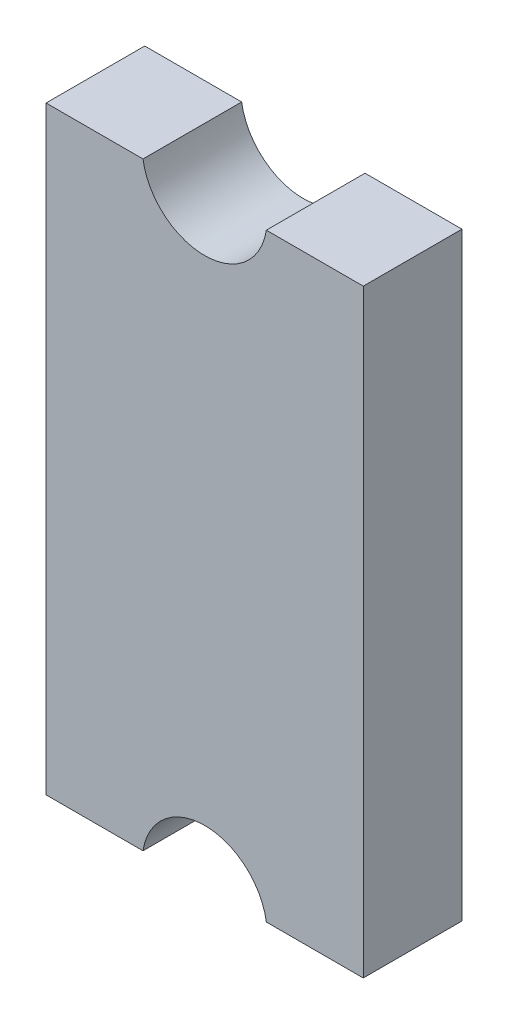
ISO-10303-21;
HEADER;
FILE_DESCRIPTION(('STEP AP214'),'2;1');
FILE_NAME('part.step','',(''),(''),'','','');
FILE_SCHEMA(('AUTOMOTIVE_DESIGN { 1 0 10303 214 1 1 1 1 }'));
ENDSEC;
DATA;
#1=APPLICATION_CONTEXT('core data for automotive mechanical design processes');
#2=APPLICATION_PROTOCOL_DEFINITION('international standard','automotive_design',2000,#1);
#3=PRODUCT_CONTEXT('',#1,'mechanical');
#4=PRODUCT('Part','Part','',(#3));
#5=PRODUCT_RELATED_PRODUCT_CATEGORY('part','',(#4));
#6=PRODUCT_DEFINITION_FORMATION('','',#4);
#7=PRODUCT_DEFINITION_CONTEXT('part definition',#1,'design');
#8=PRODUCT_DEFINITION('design','',#6,#7);
#9=PRODUCT_DEFINITION_SHAPE('','',#8);
#10=(LENGTH_UNIT() NAMED_UNIT(*) SI_UNIT(.MILLI.,.METRE.));
#11=(NAMED_UNIT(*) PLANE_ANGLE_UNIT() SI_UNIT($,.RADIAN.));
#12=(NAMED_UNIT(*) SI_UNIT($,.STERADIAN.) SOLID_ANGLE_UNIT());
#13=UNCERTAINTY_MEASURE_WITH_UNIT(LENGTH_MEASURE(1.E-05),#10,'distance_accuracy_value','');
#14=(GEOMETRIC_REPRESENTATION_CONTEXT(3) GLOBAL_UNCERTAINTY_ASSIGNED_CONTEXT((#13)) GLOBAL_UNIT_ASSIGNED_CONTEXT((#10,
#11,#12)) REPRESENTATION_CONTEXT('',''));
#15=CARTESIAN_POINT('',(0.,0.,0.));
#16=DIRECTION('',(0.,0.,1.));
#17=DIRECTION('',(1.,0.,0.));
#18=AXIS2_PLACEMENT_3D('',#15,#16,#17);
#19=CARTESIAN_POINT('',(-0.175,0.85,0.300000001192));
#20=DIRECTION('',(0.,0.,-1.));
#21=DIRECTION('',(-1.,0.,0.));
#22=AXIS2_PLACEMENT_3D('',#19,#20,#21);
#23=PLANE('',#22);
#24=DIRECTION('',(-1.,0.,0.));
#25=VECTOR('',#24,1.);
#26=CARTESIAN_POINT('',(-0.175,-0.85,0.300000001192));
#27=LINE('',#26,#25);
#28=CARTESIAN_POINT('',(-0.174999999999857,-0.85,0.300000001192));
#29=VERTEX_POINT('',#28);
#30=CARTESIAN_POINT('',(-0.45,-0.85,0.300000001192));
#31=VERTEX_POINT('',#30);
#32=EDGE_CURVE('E152',#29,#31,#27,.T.);
#33=ORIENTED_EDGE('',*,*,#32,.F.);
#34=CARTESIAN_POINT('',(0.,-0.877083333333,0.300000001192));
#35=DIRECTION('',(0.,0.,-1.));
#36=DIRECTION('',(-1.,0.,0.));
#37=AXIS2_PLACEMENT_3D('',#34,#35,#36);
#38=CIRCLE('',#37,0.177083333333);
#39=CARTESIAN_POINT('',(0.174999999999718,-0.850000000000022,0.300000001192));
#40=VERTEX_POINT('',#39);
#41=EDGE_CURVE('E20',#40,#29,#38,.F.);
#42=ORIENTED_EDGE('',*,*,#41,.F.);
#43=DIRECTION('',(-1.,0.,0.));
#44=VECTOR('',#43,1.);
#45=CARTESIAN_POINT('',(-0.175,-0.85,0.300000001192));
#46=LINE('',#45,#44);
#47=CARTESIAN_POINT('',(0.45,-0.85,0.300000001192));
#48=VERTEX_POINT('',#47);
#49=EDGE_CURVE('E62',#48,#40,#46,.T.);
#50=ORIENTED_EDGE('',*,*,#49,.F.);
#51=DIRECTION('',(0.,1.,0.));
#52=VECTOR('',#51,1.);
#53=CARTESIAN_POINT('',(0.45,0.85,0.300000001192));
#54=LINE('',#53,#52);
#55=CARTESIAN_POINT('',(0.45,0.85,0.300000001192));
#56=VERTEX_POINT('',#55);
#57=EDGE_CURVE('E131',#56,#48,#54,.F.);
#58=ORIENTED_EDGE('',*,*,#57,.F.);
#59=DIRECTION('',(1.,0.,0.));
#60=VECTOR('',#59,1.);
#61=CARTESIAN_POINT('',(0.175,0.85,0.300000001192));
#62=LINE('',#61,#60);
#63=CARTESIAN_POINT('',(0.174999999999857,0.85,0.300000001192));
#64=VERTEX_POINT('',#63);
#65=EDGE_CURVE('E86',#64,#56,#62,.T.);
#66=ORIENTED_EDGE('',*,*,#65,.F.);
#67=CARTESIAN_POINT('',(0.,0.877083333333,0.300000001192));
#68=DIRECTION('',(0.,0.,-1.));
#69=DIRECTION('',(-1.,0.,0.));
#70=AXIS2_PLACEMENT_3D('',#67,#68,#69);
#71=CIRCLE('',#70,0.177083333333);
#72=CARTESIAN_POINT('',(-0.174999999999718,0.850000000000022,0.300000001192));
#73=VERTEX_POINT('',#72);
#74=EDGE_CURVE('E104',#64,#73,#71,.T.);
#75=ORIENTED_EDGE('',*,*,#74,.T.);
#76=DIRECTION('',(1.,0.,0.));
#77=VECTOR('',#76,1.);
#78=CARTESIAN_POINT('',(-0.175,0.85,0.300000001192));
#79=LINE('',#78,#77);
#80=CARTESIAN_POINT('',(-0.45,0.85,0.300000001192));
#81=VERTEX_POINT('',#80);
#82=EDGE_CURVE('E70',#73,#81,#79,.F.);
#83=ORIENTED_EDGE('',*,*,#82,.T.);
#84=DIRECTION('',(0.,1.,0.));
#85=VECTOR('',#84,1.);
#86=CARTESIAN_POINT('',(-0.45,0.85,0.300000001192));
#87=LINE('',#86,#85);
#88=EDGE_CURVE('E102',#81,#31,#87,.F.);
#89=ORIENTED_EDGE('',*,*,#88,.T.);
#90=EDGE_LOOP('',(#33,#42,#50,#58,#66,#75,#83,#89));
#91=FACE_BOUND('',#90,.T.);
#92=ADVANCED_FACE('F17',(#91),#23,.F.);
#93=CARTESIAN_POINT('',(-0.45,0.85,0.02));
#94=DIRECTION('',(1.,0.,0.));
#95=DIRECTION('',(0.,0.,-1.));
#96=AXIS2_PLACEMENT_3D('',#93,#94,#95);
#97=PLANE('',#96);
#98=ORIENTED_EDGE('',*,*,#88,.F.);
#99=DIRECTION('',(0.,0.,-1.));
#100=VECTOR('',#99,1.);
#101=CARTESIAN_POINT('',(-0.45,0.85,0.02));
#102=LINE('',#101,#100);
#103=CARTESIAN_POINT('',(-0.45,0.85,0.02));
#104=VERTEX_POINT('',#103);
#105=EDGE_CURVE('E99',#81,#104,#102,.T.);
#106=ORIENTED_EDGE('',*,*,#105,.T.);
#107=DIRECTION('',(0.,1.,0.));
#108=VECTOR('',#107,1.);
#109=CARTESIAN_POINT('',(-0.45,0.85,0.02));
#110=LINE('',#109,#108);
#111=CARTESIAN_POINT('',(-0.45,-0.85,0.02));
#112=VERTEX_POINT('',#111);
#113=EDGE_CURVE('E96',#112,#104,#110,.T.);
#114=ORIENTED_EDGE('',*,*,#113,.F.);
#115=DIRECTION('',(0.,0.,1.));
#116=VECTOR('',#115,1.);
#117=CARTESIAN_POINT('',(-0.45,-0.85,0.02));
#118=LINE('',#117,#116);
#119=EDGE_CURVE('E119',#112,#31,#118,.T.);
#120=ORIENTED_EDGE('',*,*,#119,.T.);
#121=EDGE_LOOP('',(#98,#106,#114,#120));
#122=FACE_BOUND('',#121,.T.);
#123=ADVANCED_FACE('F101',(#122),#97,.F.);
#124=CARTESIAN_POINT('',(-0.175,0.85,0.02));
#125=DIRECTION('',(0.,-1.,0.));
#126=DIRECTION('',(0.,0.,-1.));
#127=AXIS2_PLACEMENT_3D('',#124,#125,#126);
#128=PLANE('',#127);
#129=ORIENTED_EDGE('',*,*,#82,.F.);
#130=DIRECTION('',(0.,0.,-1.));
#131=VECTOR('',#130,1.);
#132=CARTESIAN_POINT('',(-0.174999999999721,0.850000000000043,0.02));
#133=LINE('',#132,#131);
#134=CARTESIAN_POINT('',(-0.174999999999718,0.850000000000022,0.02));
#135=VERTEX_POINT('',#134);
#136=EDGE_CURVE('E110',#73,#135,#133,.T.);
#137=ORIENTED_EDGE('',*,*,#136,.T.);
#138=DIRECTION('',(-1.,0.,0.));
#139=VECTOR('',#138,1.);
#140=CARTESIAN_POINT('',(-0.175,0.85,0.02));
#141=LINE('',#140,#139);
#142=EDGE_CURVE('E107',#104,#135,#141,.F.);
#143=ORIENTED_EDGE('',*,*,#142,.F.);
#144=ORIENTED_EDGE('',*,*,#105,.F.);
#145=EDGE_LOOP('',(#129,#137,#143,#144));
#146=FACE_BOUND('',#145,.T.);
#147=ADVANCED_FACE('F108',(#146),#128,.F.);
#148=CARTESIAN_POINT('',(0.,0.877083333333,0.02));
#149=DIRECTION('',(0.,0.,-1.));
#150=DIRECTION('',(-1.,0.,0.));
#151=AXIS2_PLACEMENT_3D('',#148,#149,#150);
#152=CYLINDRICAL_SURFACE('',#151,0.177083333333);
#153=CARTESIAN_POINT('',(0.,0.877083333333,0.02));
#154=DIRECTION('',(0.,0.,-1.));
#155=DIRECTION('',(-1.,0.,0.));
#156=AXIS2_PLACEMENT_3D('',#153,#154,#155);
#157=CIRCLE('',#156,0.177083333333);
#158=CARTESIAN_POINT('',(0.174999999999857,0.85,0.02));
#159=VERTEX_POINT('',#158);
#160=EDGE_CURVE('E114',#135,#159,#157,.F.);
#161=ORIENTED_EDGE('',*,*,#160,.F.);
#162=ORIENTED_EDGE('',*,*,#136,.F.);
#163=ORIENTED_EDGE('',*,*,#74,.F.);
#164=DIRECTION('',(0.,0.,1.));
#165=VECTOR('',#164,1.);
#166=CARTESIAN_POINT('',(0.175,0.85,0.02));
#167=LINE('',#166,#165);
#168=EDGE_CURVE('E146',#159,#64,#167,.T.);
#169=ORIENTED_EDGE('',*,*,#168,.F.);
#170=EDGE_LOOP('',(#161,#162,#163,#169));
#171=FACE_BOUND('',#170,.T.);
#172=ADVANCED_FACE('F173',(#171),#152,.F.);
#173=CARTESIAN_POINT('',(0.175,0.85,0.02));
#174=DIRECTION('',(0.,1.,0.));
#175=DIRECTION('',(0.,0.,1.));
#176=AXIS2_PLACEMENT_3D('',#173,#174,#175);
#177=PLANE('',#176);
#178=ORIENTED_EDGE('',*,*,#168,.T.);
#179=ORIENTED_EDGE('',*,*,#65,.T.);
#180=DIRECTION('',(0.,0.,-1.));
#181=VECTOR('',#180,1.);
#182=CARTESIAN_POINT('',(0.45,0.85,0.02));
#183=LINE('',#182,#181);
#184=CARTESIAN_POINT('',(0.45,0.85,0.02));
#185=VERTEX_POINT('',#184);
#186=EDGE_CURVE('E141',#185,#56,#183,.F.);
#187=ORIENTED_EDGE('',*,*,#186,.F.);
#188=DIRECTION('',(-1.,0.,0.));
#189=VECTOR('',#188,1.);
#190=CARTESIAN_POINT('',(-0.175,0.85,0.02));
#191=LINE('',#190,#189);
#192=EDGE_CURVE('E138',#159,#185,#191,.F.);
#193=ORIENTED_EDGE('',*,*,#192,.F.);
#194=EDGE_LOOP('',(#178,#179,#187,#193));
#195=FACE_BOUND('',#194,.T.);
#196=ADVANCED_FACE('F195',(#195),#177,.T.);
#197=CARTESIAN_POINT('',(0.45,0.85,0.02));
#198=DIRECTION('',(1.,0.,0.));
#199=DIRECTION('',(0.,0.,-1.));
#200=AXIS2_PLACEMENT_3D('',#197,#198,#199);
#201=PLANE('',#200);
#202=ORIENTED_EDGE('',*,*,#186,.T.);
#203=ORIENTED_EDGE('',*,*,#57,.T.);
#204=DIRECTION('',(0.,0.,-1.));
#205=VECTOR('',#204,1.);
#206=CARTESIAN_POINT('',(0.45,-0.85,0.02));
#207=LINE('',#206,#205);
#208=CARTESIAN_POINT('',(0.45,-0.85,0.02));
#209=VERTEX_POINT('',#208);
#210=EDGE_CURVE('E129',#209,#48,#207,.F.);
#211=ORIENTED_EDGE('',*,*,#210,.F.);
#212=DIRECTION('',(0.,1.,0.));
#213=VECTOR('',#212,1.);
#214=CARTESIAN_POINT('',(0.45,0.85,0.02));
#215=LINE('',#214,#213);
#216=EDGE_CURVE('E134',#185,#209,#215,.F.);
#217=ORIENTED_EDGE('',*,*,#216,.F.);
#218=EDGE_LOOP('',(#202,#203,#211,#217));
#219=FACE_BOUND('',#218,.T.);
#220=ADVANCED_FACE('F194',(#219),#201,.T.);
#221=CARTESIAN_POINT('',(0.45,-0.85,0.02));
#222=DIRECTION('',(0.,-1.,0.));
#223=DIRECTION('',(0.,0.,-1.));
#224=AXIS2_PLACEMENT_3D('',#221,#222,#223);
#225=PLANE('',#224);
#226=ORIENTED_EDGE('',*,*,#210,.T.);
#227=ORIENTED_EDGE('',*,*,#49,.T.);
#228=DIRECTION('',(0.,0.,-1.));
#229=VECTOR('',#228,1.);
#230=CARTESIAN_POINT('',(0.174999999999721,-0.850000000000043,0.02));
#231=LINE('',#230,#229);
#232=CARTESIAN_POINT('',(0.174999999999718,-0.850000000000022,0.02));
#233=VERTEX_POINT('',#232);
#234=EDGE_CURVE('E127',#40,#233,#231,.T.);
#235=ORIENTED_EDGE('',*,*,#234,.T.);
#236=DIRECTION('',(-1.,0.,0.));
#237=VECTOR('',#236,1.);
#238=CARTESIAN_POINT('',(-0.175,-0.85,0.02));
#239=LINE('',#238,#237);
#240=EDGE_CURVE('E137',#209,#233,#239,.T.);
#241=ORIENTED_EDGE('',*,*,#240,.F.);
#242=EDGE_LOOP('',(#226,#227,#235,#241));
#243=FACE_BOUND('',#242,.T.);
#244=ADVANCED_FACE('F190',(#243),#225,.T.);
#245=CARTESIAN_POINT('',(0.,-0.877083333333,0.02));
#246=DIRECTION('',(0.,0.,-1.));
#247=DIRECTION('',(-1.,0.,0.));
#248=AXIS2_PLACEMENT_3D('',#245,#246,#247);
#249=CYLINDRICAL_SURFACE('',#248,0.177083333333);
#250=CARTESIAN_POINT('',(0.,-0.877083333333,0.02));
#251=DIRECTION('',(0.,0.,-1.));
#252=DIRECTION('',(-1.,0.,0.));
#253=AXIS2_PLACEMENT_3D('',#250,#251,#252);
#254=CIRCLE('',#253,0.177083333333);
#255=CARTESIAN_POINT('',(-0.174999999999857,-0.85,0.02));
#256=VERTEX_POINT('',#255);
#257=EDGE_CURVE('E26',#233,#256,#254,.F.);
#258=ORIENTED_EDGE('',*,*,#257,.F.);
#259=ORIENTED_EDGE('',*,*,#234,.F.);
#260=ORIENTED_EDGE('',*,*,#41,.T.);
#261=DIRECTION('',(0.,0.,1.));
#262=VECTOR('',#261,1.);
#263=CARTESIAN_POINT('',(-0.175,-0.85,0.02));
#264=LINE('',#263,#262);
#265=EDGE_CURVE('E35',#29,#256,#264,.F.);
#266=ORIENTED_EDGE('',*,*,#265,.T.);
#267=EDGE_LOOP('',(#258,#259,#260,#266));
#268=FACE_BOUND('',#267,.T.);
#269=ADVANCED_FACE('F189',(#268),#249,.F.);
#270=CARTESIAN_POINT('',(-0.45,-0.85,0.02));
#271=DIRECTION('',(0.,1.,0.));
#272=DIRECTION('',(0.,0.,1.));
#273=AXIS2_PLACEMENT_3D('',#270,#271,#272);
#274=PLANE('',#273);
#275=ORIENTED_EDGE('',*,*,#32,.T.);
#276=ORIENTED_EDGE('',*,*,#119,.F.);
#277=DIRECTION('',(-1.,0.,0.));
#278=VECTOR('',#277,1.);
#279=CARTESIAN_POINT('',(-0.175,-0.85,0.02));
#280=LINE('',#279,#278);
#281=EDGE_CURVE('E11',#256,#112,#280,.T.);
#282=ORIENTED_EDGE('',*,*,#281,.F.);
#283=ORIENTED_EDGE('',*,*,#265,.F.);
#284=EDGE_LOOP('',(#275,#276,#282,#283));
#285=FACE_BOUND('',#284,.T.);
#286=ADVANCED_FACE('F187',(#285),#274,.F.);
#287=CARTESIAN_POINT('',(-0.175,0.85,0.02));
#288=DIRECTION('',(0.,0.,-1.));
#289=DIRECTION('',(-1.,0.,0.));
#290=AXIS2_PLACEMENT_3D('',#287,#288,#289);
#291=PLANE('',#290);
#292=ORIENTED_EDGE('',*,*,#257,.T.);
#293=ORIENTED_EDGE('',*,*,#281,.T.);
#294=ORIENTED_EDGE('',*,*,#113,.T.);
#295=ORIENTED_EDGE('',*,*,#142,.T.);
#296=ORIENTED_EDGE('',*,*,#160,.T.);
#297=ORIENTED_EDGE('',*,*,#192,.T.);
#298=ORIENTED_EDGE('',*,*,#216,.T.);
#299=ORIENTED_EDGE('',*,*,#240,.T.);
#300=EDGE_LOOP('',(#292,#293,#294,#295,#296,#297,#298,#299));
#301=FACE_BOUND('',#300,.T.);
#302=ADVANCED_FACE('F117',(#301),#291,.T.);
#303=CLOSED_SHELL('',(#92,#123,#147,#172,#196,#220,#244,#269,#286,#302));
#304=MANIFOLD_SOLID_BREP('B1',#303);
#305=ADVANCED_BREP_SHAPE_REPRESENTATION('',(#18,#304),#14);
#306=SHAPE_DEFINITION_REPRESENTATION(#9,#305);
ENDSEC;
END-ISO-10303-21;
